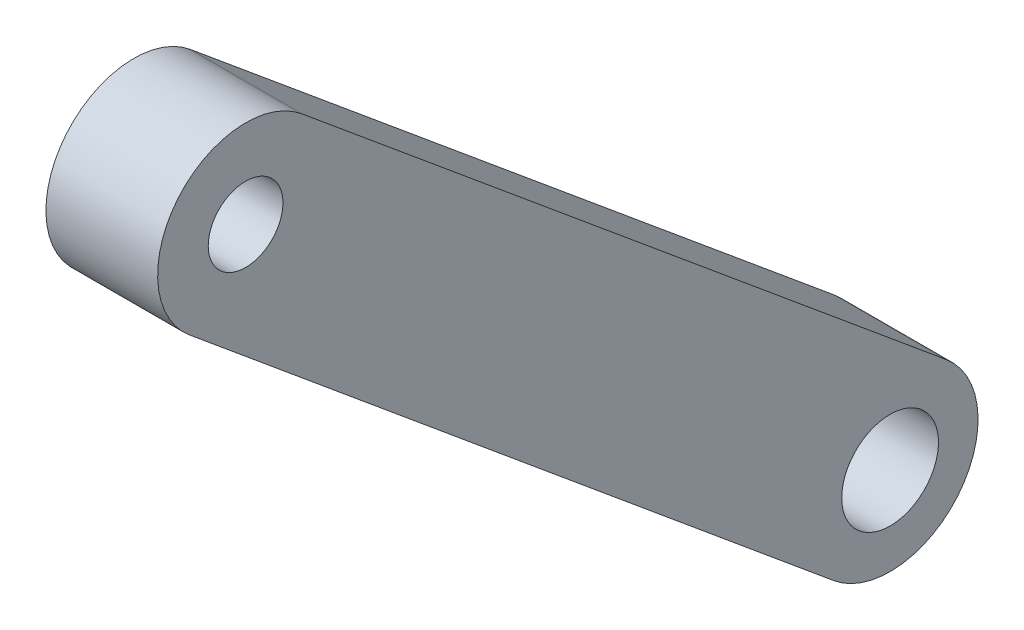
ISO-10303-21;
HEADER;
FILE_DESCRIPTION(('STEP AP214'),'2;1');
FILE_NAME('part.step','',(''),(''),'','','');
FILE_SCHEMA(('AUTOMOTIVE_DESIGN { 1 0 10303 214 1 1 1 1 }'));
ENDSEC;
DATA;
#1=APPLICATION_CONTEXT('core data for automotive mechanical design processes');
#2=APPLICATION_PROTOCOL_DEFINITION('international standard','automotive_design',2000,#1);
#3=PRODUCT_CONTEXT('',#1,'mechanical');
#4=PRODUCT('Part','Part','',(#3));
#5=PRODUCT_RELATED_PRODUCT_CATEGORY('part','',(#4));
#6=PRODUCT_DEFINITION_FORMATION('','',#4);
#7=PRODUCT_DEFINITION_CONTEXT('part definition',#1,'design');
#8=PRODUCT_DEFINITION('design','',#6,#7);
#9=PRODUCT_DEFINITION_SHAPE('','',#8);
#10=(LENGTH_UNIT() NAMED_UNIT(*) SI_UNIT(.MILLI.,.METRE.));
#11=(NAMED_UNIT(*) PLANE_ANGLE_UNIT() SI_UNIT($,.RADIAN.));
#12=(NAMED_UNIT(*) SI_UNIT($,.STERADIAN.) SOLID_ANGLE_UNIT());
#13=UNCERTAINTY_MEASURE_WITH_UNIT(LENGTH_MEASURE(1.E-05),#10,'distance_accuracy_value','');
#14=(GEOMETRIC_REPRESENTATION_CONTEXT(3) GLOBAL_UNCERTAINTY_ASSIGNED_CONTEXT((#13)) GLOBAL_UNIT_ASSIGNED_CONTEXT((#10,
#11,#12)) REPRESENTATION_CONTEXT('',''));
#15=CARTESIAN_POINT('',(0.,0.,0.));
#16=DIRECTION('',(0.,0.,1.));
#17=DIRECTION('',(1.,0.,0.));
#18=AXIS2_PLACEMENT_3D('',#15,#16,#17);
#19=CARTESIAN_POINT('',(12.4177777777778,27.0815841429825,497.045627926798));
#20=DIRECTION('',(1.,0.,0.));
#21=DIRECTION('',(0.,0.,-1.));
#22=AXIS2_PLACEMENT_3D('',#19,#20,#21);
#23=CYLINDRICAL_SURFACE('',#22,4.);
#24=CARTESIAN_POINT('',(17.4977777777778,27.0815841429825,497.045627926798));
#25=DIRECTION('',(1.,0.,0.));
#26=DIRECTION('',(0.,0.,-1.));
#27=AXIS2_PLACEMENT_3D('',#24,#25,#26);
#28=CIRCLE('',#27,4.);
#29=CARTESIAN_POINT('',(17.4977777777778,30.1591497183071,494.490517336319));
#30=VERTEX_POINT('',#29);
#31=CARTESIAN_POINT('',(17.4977777777778,24.0040185676578,499.600738517277));
#32=VERTEX_POINT('',#31);
#33=EDGE_CURVE('E116',#30,#32,#28,.T.);
#34=ORIENTED_EDGE('',*,*,#33,.F.);
#35=DIRECTION('',(1.,0.,0.));
#36=VECTOR('',#35,1.);
#37=CARTESIAN_POINT('',(12.4177777777778,30.1591497183071,494.490517336319));
#38=LINE('',#37,#36);
#39=CARTESIAN_POINT('',(12.4177777777778,30.1591497183071,494.490517336319));
#40=VERTEX_POINT('',#39);
#41=EDGE_CURVE('E11',#40,#30,#38,.T.);
#42=ORIENTED_EDGE('',*,*,#41,.F.);
#43=CARTESIAN_POINT('',(12.4177777777778,27.0815841429825,497.045627926798));
#44=DIRECTION('',(1.,0.,0.));
#45=DIRECTION('',(0.,0.,-1.));
#46=AXIS2_PLACEMENT_3D('',#43,#44,#45);
#47=CIRCLE('',#46,4.);
#48=CARTESIAN_POINT('',(12.4177777777778,24.0040185676578,499.600738517277));
#49=VERTEX_POINT('',#48);
#50=EDGE_CURVE('E107',#40,#49,#47,.T.);
#51=ORIENTED_EDGE('',*,*,#50,.T.);
#52=DIRECTION('',(1.,0.,0.));
#53=VECTOR('',#52,1.);
#54=CARTESIAN_POINT('',(12.4177777777778,24.0040185676578,499.600738517277));
#55=LINE('',#54,#53);
#56=EDGE_CURVE('E48',#49,#32,#55,.T.);
#57=ORIENTED_EDGE('',*,*,#56,.T.);
#58=EDGE_LOOP('',(#34,#42,#51,#57));
#59=FACE_BOUND('',#58,.T.);
#60=ADVANCED_FACE('F45',(#59),#23,.T.);
#61=CARTESIAN_POINT('',(12.4177777777778,5.82172134399743,465.176705231352));
#62=DIRECTION('',(0.,0.769391393831164,-0.638777647619686));
#63=DIRECTION('',(0.,0.638777647619686,0.769391393831164));
#64=AXIS2_PLACEMENT_3D('',#61,#62,#63);
#65=PLANE('',#64);
#66=DIRECTION('',(0.,0.638777647619686,0.769391393831164));
#67=VECTOR('',#66,1.);
#68=CARTESIAN_POINT('',(17.4977777777778,5.82172134399743,465.176705231352));
#69=LINE('',#68,#67);
#70=CARTESIAN_POINT('',(17.4977777777778,5.82172134399743,465.176705231352));
#71=VERTEX_POINT('',#70);
#72=EDGE_CURVE('E110',#71,#30,#69,.T.);
#73=ORIENTED_EDGE('',*,*,#72,.F.);
#74=DIRECTION('',(1.,0.,0.));
#75=VECTOR('',#74,1.);
#76=CARTESIAN_POINT('',(12.4177777777778,5.82172134399743,465.176705231352));
#77=LINE('',#76,#75);
#78=CARTESIAN_POINT('',(12.4177777777778,5.82172134399743,465.176705231352));
#79=VERTEX_POINT('',#78);
#80=EDGE_CURVE('E55',#79,#71,#77,.T.);
#81=ORIENTED_EDGE('',*,*,#80,.F.);
#82=DIRECTION('',(0.,0.638777647619686,0.769391393831164));
#83=VECTOR('',#82,1.);
#84=CARTESIAN_POINT('',(12.4177777777778,5.82172134399743,465.176705231352));
#85=LINE('',#84,#83);
#86=EDGE_CURVE('E102',#79,#40,#85,.T.);
#87=ORIENTED_EDGE('',*,*,#86,.T.);
#88=ORIENTED_EDGE('',*,*,#41,.T.);
#89=EDGE_LOOP('',(#73,#81,#87,#88));
#90=FACE_BOUND('',#89,.T.);
#91=ADVANCED_FACE('F133',(#90),#65,.T.);
#92=CARTESIAN_POINT('',(12.4177777777778,2.74415576867277,467.731815821831));
#93=DIRECTION('',(1.,0.,0.));
#94=DIRECTION('',(0.,0.,-1.));
#95=AXIS2_PLACEMENT_3D('',#92,#93,#94);
#96=CYLINDRICAL_SURFACE('',#95,4.00000000000002);
#97=CARTESIAN_POINT('',(17.4977777777778,2.74415576867277,467.731815821831));
#98=DIRECTION('',(1.,0.,0.));
#99=DIRECTION('',(0.,0.,-1.));
#100=AXIS2_PLACEMENT_3D('',#97,#98,#99);
#101=CIRCLE('',#100,4.00000000000002);
#102=CARTESIAN_POINT('',(17.4977777777778,-0.333409806651901,470.28692641231));
#103=VERTEX_POINT('',#102);
#104=EDGE_CURVE('E96',#103,#71,#101,.T.);
#105=ORIENTED_EDGE('',*,*,#104,.F.);
#106=DIRECTION('',(1.,0.,0.));
#107=VECTOR('',#106,1.);
#108=CARTESIAN_POINT('',(12.4177777777778,-0.333409806651901,470.28692641231));
#109=LINE('',#108,#107);
#110=CARTESIAN_POINT('',(12.4177777777778,-0.333409806651901,470.28692641231));
#111=VERTEX_POINT('',#110);
#112=EDGE_CURVE('E91',#111,#103,#109,.T.);
#113=ORIENTED_EDGE('',*,*,#112,.F.);
#114=CARTESIAN_POINT('',(12.4177777777778,2.74415576867277,467.731815821831));
#115=DIRECTION('',(1.,0.,0.));
#116=DIRECTION('',(0.,0.,-1.));
#117=AXIS2_PLACEMENT_3D('',#114,#115,#116);
#118=CIRCLE('',#117,4.00000000000002);
#119=EDGE_CURVE('E94',#111,#79,#118,.T.);
#120=ORIENTED_EDGE('',*,*,#119,.T.);
#121=ORIENTED_EDGE('',*,*,#80,.T.);
#122=EDGE_LOOP('',(#105,#113,#120,#121));
#123=FACE_BOUND('',#122,.T.);
#124=ADVANCED_FACE('F93',(#123),#96,.T.);
#125=CARTESIAN_POINT('',(12.4177777777778,24.0040185676578,499.600738517277));
#126=DIRECTION('',(0.,-0.769391393831163,0.638777647619686));
#127=DIRECTION('',(0.,-0.638777647619686,-0.769391393831163));
#128=AXIS2_PLACEMENT_3D('',#125,#126,#127);
#129=PLANE('',#128);
#130=DIRECTION('',(0.,-0.638777647619686,-0.769391393831163));
#131=VECTOR('',#130,1.);
#132=CARTESIAN_POINT('',(17.4977777777778,24.0040185676578,499.600738517277));
#133=LINE('',#132,#131);
#134=EDGE_CURVE('E120',#32,#103,#133,.T.);
#135=ORIENTED_EDGE('',*,*,#134,.F.);
#136=ORIENTED_EDGE('',*,*,#56,.F.);
#137=DIRECTION('',(0.,-0.638777647619686,-0.769391393831163));
#138=VECTOR('',#137,1.);
#139=CARTESIAN_POINT('',(12.4177777777778,24.0040185676578,499.600738517277));
#140=LINE('',#139,#138);
#141=EDGE_CURVE('E101',#49,#111,#140,.T.);
#142=ORIENTED_EDGE('',*,*,#141,.T.);
#143=ORIENTED_EDGE('',*,*,#112,.T.);
#144=EDGE_LOOP('',(#135,#136,#142,#143));
#145=FACE_BOUND('',#144,.T.);
#146=ADVANCED_FACE('F105',(#145),#129,.T.);
#147=CARTESIAN_POINT('',(12.4177777777778,27.0815841429825,497.045627926798));
#148=DIRECTION('',(1.,0.,0.));
#149=DIRECTION('',(0.,0.,-1.));
#150=AXIS2_PLACEMENT_3D('',#147,#148,#149);
#151=PLANE('',#150);
#152=CARTESIAN_POINT('',(12.4177777777778,27.0815841429825,497.045627926798));
#153=DIRECTION('',(1.,0.,0.));
#154=DIRECTION('',(0.,0.,1.));
#155=AXIS2_PLACEMENT_3D('',#152,#153,#154);
#156=CIRCLE('',#155,1.69999999999996);
#157=CARTESIAN_POINT('',(12.4177777777778,27.0815841429825,498.745627926798));
#158=VERTEX_POINT('',#157);
#159=EDGE_CURVE('E166',#158,#158,#156,.T.);
#160=ORIENTED_EDGE('',*,*,#159,.T.);
#161=EDGE_LOOP('',(#160));
#162=FACE_BOUND('',#161,.T.);
#163=CARTESIAN_POINT('',(12.4177777777778,2.74415576867277,467.731815821831));
#164=DIRECTION('',(1.,0.,0.));
#165=DIRECTION('',(0.,0.,1.));
#166=AXIS2_PLACEMENT_3D('',#163,#164,#165);
#167=CIRCLE('',#166,2.19999999999998);
#168=CARTESIAN_POINT('',(12.4177777777778,2.74415576867277,469.931815821831));
#169=VERTEX_POINT('',#168);
#170=EDGE_CURVE('E121',#169,#169,#167,.T.);
#171=ORIENTED_EDGE('',*,*,#170,.T.);
#172=EDGE_LOOP('',(#171));
#173=FACE_BOUND('',#172,.T.);
#174=ORIENTED_EDGE('',*,*,#50,.F.);
#175=ORIENTED_EDGE('',*,*,#86,.F.);
#176=ORIENTED_EDGE('',*,*,#119,.F.);
#177=ORIENTED_EDGE('',*,*,#141,.F.);
#178=EDGE_LOOP('',(#174,#175,#176,#177));
#179=FACE_BOUND('',#178,.T.);
#180=ADVANCED_FACE('F100',(#162,#173,#179),#151,.F.);
#181=CARTESIAN_POINT('',(17.4977777777778,27.0815841429825,497.045627926798));
#182=DIRECTION('',(1.,0.,0.));
#183=DIRECTION('',(0.,0.,-1.));
#184=AXIS2_PLACEMENT_3D('',#181,#182,#183);
#185=PLANE('',#184);
#186=CARTESIAN_POINT('',(17.4977777777778,27.0815841429825,497.045627926798));
#187=DIRECTION('',(1.,0.,0.));
#188=DIRECTION('',(0.,0.,1.));
#189=AXIS2_PLACEMENT_3D('',#186,#187,#188);
#190=CIRCLE('',#189,1.69999999999996);
#191=CARTESIAN_POINT('',(17.4977777777778,27.0815841429825,498.745627926798));
#192=VERTEX_POINT('',#191);
#193=EDGE_CURVE('E169',#192,#192,#190,.T.);
#194=ORIENTED_EDGE('',*,*,#193,.F.);
#195=EDGE_LOOP('',(#194));
#196=FACE_BOUND('',#195,.T.);
#197=CARTESIAN_POINT('',(17.4977777777778,2.74415576867277,467.731815821831));
#198=DIRECTION('',(1.,0.,0.));
#199=DIRECTION('',(0.,0.,1.));
#200=AXIS2_PLACEMENT_3D('',#197,#198,#199);
#201=CIRCLE('',#200,2.19999999999998);
#202=CARTESIAN_POINT('',(17.4977777777778,2.74415576867277,469.931815821831));
#203=VERTEX_POINT('',#202);
#204=EDGE_CURVE('E173',#203,#203,#201,.T.);
#205=ORIENTED_EDGE('',*,*,#204,.F.);
#206=EDGE_LOOP('',(#205));
#207=FACE_BOUND('',#206,.T.);
#208=ORIENTED_EDGE('',*,*,#33,.T.);
#209=ORIENTED_EDGE('',*,*,#134,.T.);
#210=ORIENTED_EDGE('',*,*,#104,.T.);
#211=ORIENTED_EDGE('',*,*,#72,.T.);
#212=EDGE_LOOP('',(#208,#209,#210,#211));
#213=FACE_BOUND('',#212,.T.);
#214=ADVANCED_FACE('F132',(#196,#207,#213),#185,.T.);
#215=CARTESIAN_POINT('',(12.4177777777778,2.74415576867277,467.731815821831));
#216=DIRECTION('',(1.,0.,0.));
#217=DIRECTION('',(0.,0.,-1.));
#218=AXIS2_PLACEMENT_3D('',#215,#216,#217);
#219=CYLINDRICAL_SURFACE('',#218,2.19999999999998);
#220=ORIENTED_EDGE('',*,*,#170,.F.);
#221=EDGE_LOOP('',(#220));
#222=FACE_BOUND('',#221,.T.);
#223=ORIENTED_EDGE('',*,*,#204,.T.);
#224=EDGE_LOOP('',(#223));
#225=FACE_BOUND('',#224,.T.);
#226=ADVANCED_FACE('F151',(#222,#225),#219,.F.);
#227=CARTESIAN_POINT('',(12.4177777777778,27.0815841429825,497.045627926798));
#228=DIRECTION('',(1.,0.,0.));
#229=DIRECTION('',(0.,0.,-1.));
#230=AXIS2_PLACEMENT_3D('',#227,#228,#229);
#231=CYLINDRICAL_SURFACE('',#230,1.69999999999996);
#232=ORIENTED_EDGE('',*,*,#159,.F.);
#233=EDGE_LOOP('',(#232));
#234=FACE_BOUND('',#233,.T.);
#235=ORIENTED_EDGE('',*,*,#193,.T.);
#236=EDGE_LOOP('',(#235));
#237=FACE_BOUND('',#236,.T.);
#238=ADVANCED_FACE('F158',(#234,#237),#231,.F.);
#239=CLOSED_SHELL('',(#60,#91,#124,#146,#180,#214,#226,#238));
#240=MANIFOLD_SOLID_BREP('B2',#239);
#241=ADVANCED_BREP_SHAPE_REPRESENTATION('',(#18,#240),#14);
#242=SHAPE_DEFINITION_REPRESENTATION(#9,#241);
ENDSEC;
END-ISO-10303-21;
